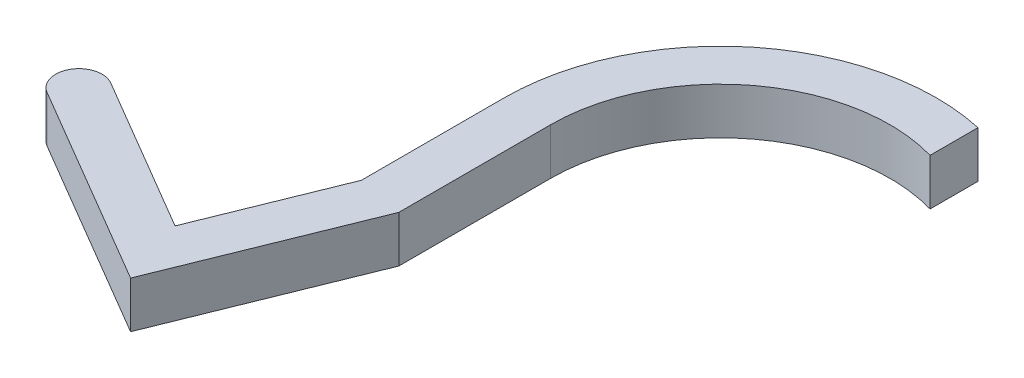
ISO-10303-21;
HEADER;
FILE_DESCRIPTION(('STEP AP214'),'2;1');
FILE_NAME('part.step','',(''),(''),'','','');
FILE_SCHEMA(('AUTOMOTIVE_DESIGN { 1 0 10303 214 1 1 1 1 }'));
ENDSEC;
DATA;
#1=APPLICATION_CONTEXT('core data for automotive mechanical design processes');
#2=APPLICATION_PROTOCOL_DEFINITION('international standard','automotive_design',2000,#1);
#3=PRODUCT_CONTEXT('',#1,'mechanical');
#4=PRODUCT('Part','Part','',(#3));
#5=PRODUCT_RELATED_PRODUCT_CATEGORY('part','',(#4));
#6=PRODUCT_DEFINITION_FORMATION('','',#4);
#7=PRODUCT_DEFINITION_CONTEXT('part definition',#1,'design');
#8=PRODUCT_DEFINITION('design','',#6,#7);
#9=PRODUCT_DEFINITION_SHAPE('','',#8);
#10=(LENGTH_UNIT() NAMED_UNIT(*) SI_UNIT(.MILLI.,.METRE.));
#11=(NAMED_UNIT(*) PLANE_ANGLE_UNIT() SI_UNIT($,.RADIAN.));
#12=(NAMED_UNIT(*) SI_UNIT($,.STERADIAN.) SOLID_ANGLE_UNIT());
#13=UNCERTAINTY_MEASURE_WITH_UNIT(LENGTH_MEASURE(1.E-05),#10,'distance_accuracy_value','');
#14=(GEOMETRIC_REPRESENTATION_CONTEXT(3) GLOBAL_UNCERTAINTY_ASSIGNED_CONTEXT((#13)) GLOBAL_UNIT_ASSIGNED_CONTEXT((#10,
#11,#12)) REPRESENTATION_CONTEXT('',''));
#15=CARTESIAN_POINT('',(0.,0.,0.));
#16=DIRECTION('',(0.,0.,1.));
#17=DIRECTION('',(1.,0.,0.));
#18=AXIS2_PLACEMENT_3D('',#15,#16,#17);
#19=CARTESIAN_POINT('',(0.,10.,0.));
#20=DIRECTION('',(0.,-1.,0.));
#21=DIRECTION('',(0.,0.,-1.));
#22=AXIS2_PLACEMENT_3D('',#19,#20,#21);
#23=CYLINDRICAL_SURFACE('',#22,46.5);
#24=CARTESIAN_POINT('',(0.,0.,0.));
#25=DIRECTION('',(0.,1.,0.));
#26=DIRECTION('',(0.,0.,-1.));
#27=AXIS2_PLACEMENT_3D('',#24,#25,#26);
#28=CIRCLE('',#27,46.5);
#29=CARTESIAN_POINT('',(9.99999999999999,0.,-45.4120028186382));
#30=VERTEX_POINT('',#29);
#31=CARTESIAN_POINT('',(-46.5,0.,0.));
#32=VERTEX_POINT('',#31);
#33=EDGE_CURVE('E128',#30,#32,#28,.T.);
#34=ORIENTED_EDGE('',*,*,#33,.T.);
#35=DIRECTION('',(0.,-1.,0.));
#36=VECTOR('',#35,1.);
#37=CARTESIAN_POINT('',(-46.5,10.,0.));
#38=LINE('',#37,#36);
#39=CARTESIAN_POINT('',(-46.5,10.,0.));
#40=VERTEX_POINT('',#39);
#41=EDGE_CURVE('E11',#40,#32,#38,.T.);
#42=ORIENTED_EDGE('',*,*,#41,.F.);
#43=CARTESIAN_POINT('',(0.,10.,0.));
#44=DIRECTION('',(0.,1.,0.));
#45=DIRECTION('',(0.,0.,-1.));
#46=AXIS2_PLACEMENT_3D('',#43,#44,#45);
#47=CIRCLE('',#46,46.5);
#48=CARTESIAN_POINT('',(9.99999999999999,10.,-45.4120028186382));
#49=VERTEX_POINT('',#48);
#50=EDGE_CURVE('E80',#49,#40,#47,.T.);
#51=ORIENTED_EDGE('',*,*,#50,.F.);
#52=DIRECTION('',(0.,-1.,0.));
#53=VECTOR('',#52,1.);
#54=CARTESIAN_POINT('',(9.99999999999999,10.,-45.4120028186382));
#55=LINE('',#54,#53);
#56=EDGE_CURVE('E191',#49,#30,#55,.T.);
#57=ORIENTED_EDGE('',*,*,#56,.T.);
#58=EDGE_LOOP('',(#34,#42,#51,#57));
#59=FACE_BOUND('',#58,.T.);
#60=ADVANCED_FACE('F38',(#59),#23,.T.);
#61=CARTESIAN_POINT('',(0.,10.,0.));
#62=DIRECTION('',(0.,-1.,0.));
#63=DIRECTION('',(0.,0.,-1.));
#64=AXIS2_PLACEMENT_3D('',#61,#62,#63);
#65=CYLINDRICAL_SURFACE('',#64,36.5);
#66=CARTESIAN_POINT('',(0.,0.,0.));
#67=DIRECTION('',(0.,-1.,0.));
#68=DIRECTION('',(0.,0.,-1.));
#69=AXIS2_PLACEMENT_3D('',#66,#67,#68);
#70=CIRCLE('',#69,36.5);
#71=CARTESIAN_POINT('',(-36.5,0.,0.));
#72=VERTEX_POINT('',#71);
#73=CARTESIAN_POINT('',(9.99999999999999,0.,-35.1034186369362));
#74=VERTEX_POINT('',#73);
#75=EDGE_CURVE('E69',#72,#74,#70,.T.);
#76=ORIENTED_EDGE('',*,*,#75,.T.);
#77=DIRECTION('',(0.,-1.,0.));
#78=VECTOR('',#77,1.);
#79=CARTESIAN_POINT('',(9.99999999999999,10.,-35.1034186369362));
#80=LINE('',#79,#78);
#81=CARTESIAN_POINT('',(9.99999999999999,10.,-35.1034186369362));
#82=VERTEX_POINT('',#81);
#83=EDGE_CURVE('E136',#82,#74,#80,.T.);
#84=ORIENTED_EDGE('',*,*,#83,.F.);
#85=CARTESIAN_POINT('',(0.,10.,0.));
#86=DIRECTION('',(0.,-1.,0.));
#87=DIRECTION('',(0.,0.,-1.));
#88=AXIS2_PLACEMENT_3D('',#85,#86,#87);
#89=CIRCLE('',#88,36.5);
#90=CARTESIAN_POINT('',(-36.5,10.,0.));
#91=VERTEX_POINT('',#90);
#92=EDGE_CURVE('E132',#91,#82,#89,.T.);
#93=ORIENTED_EDGE('',*,*,#92,.F.);
#94=DIRECTION('',(0.,-1.,0.));
#95=VECTOR('',#94,1.);
#96=CARTESIAN_POINT('',(-36.5,10.,0.));
#97=LINE('',#96,#95);
#98=EDGE_CURVE('E46',#91,#72,#97,.T.);
#99=ORIENTED_EDGE('',*,*,#98,.T.);
#100=EDGE_LOOP('',(#76,#84,#93,#99));
#101=FACE_BOUND('',#100,.T.);
#102=ADVANCED_FACE('F131',(#101),#65,.F.);
#103=CARTESIAN_POINT('',(9.99999999999999,10.,-45.4120028186382));
#104=DIRECTION('',(-1.,0.,0.));
#105=DIRECTION('',(0.,0.,1.));
#106=AXIS2_PLACEMENT_3D('',#103,#104,#105);
#107=PLANE('',#106);
#108=DIRECTION('',(0.,0.,-1.));
#109=VECTOR('',#108,1.);
#110=CARTESIAN_POINT('',(9.99999999999999,0.,-45.4120028186382));
#111=LINE('',#110,#109);
#112=EDGE_CURVE('E75',#74,#30,#111,.T.);
#113=ORIENTED_EDGE('',*,*,#112,.T.);
#114=ORIENTED_EDGE('',*,*,#56,.F.);
#115=DIRECTION('',(0.,0.,-1.));
#116=VECTOR('',#115,1.);
#117=CARTESIAN_POINT('',(9.99999999999999,10.,-45.4120028186382));
#118=LINE('',#117,#116);
#119=EDGE_CURVE('E54',#82,#49,#118,.T.);
#120=ORIENTED_EDGE('',*,*,#119,.F.);
#121=ORIENTED_EDGE('',*,*,#83,.T.);
#122=EDGE_LOOP('',(#113,#114,#120,#121));
#123=FACE_BOUND('',#122,.T.);
#124=ADVANCED_FACE('F195',(#123),#107,.F.);
#125=CARTESIAN_POINT('',(0.,10.,0.));
#126=DIRECTION('',(0.,-1.,0.));
#127=DIRECTION('',(0.,0.,-1.));
#128=AXIS2_PLACEMENT_3D('',#125,#126,#127);
#129=PLANE('',#128);
#130=ORIENTED_EDGE('',*,*,#50,.T.);
#131=DIRECTION('',(0.,0.,1.));
#132=VECTOR('',#131,1.);
#133=CARTESIAN_POINT('',(-46.5,10.,0.));
#134=LINE('',#133,#132);
#135=CARTESIAN_POINT('',(-46.5,10.,30.7026845183152));
#136=VERTEX_POINT('',#135);
#137=EDGE_CURVE('E165',#40,#136,#134,.T.);
#138=ORIENTED_EDGE('',*,*,#137,.T.);
#139=DIRECTION('',(-0.374907361228939,0.,0.927062279729012));
#140=VECTOR('',#139,1.);
#141=CARTESIAN_POINT('',(-46.5,10.,30.7026845183152));
#142=LINE('',#141,#140);
#143=CARTESIAN_POINT('',(-58.0348229185915,10.,59.22572870749));
#144=VERTEX_POINT('',#143);
#145=EDGE_CURVE('E167',#136,#144,#142,.T.);
#146=ORIENTED_EDGE('',*,*,#145,.T.);
#147=DIRECTION('',(-0.86216242099645,0.,-0.506631976706504));
#148=VECTOR('',#147,1.);
#149=CARTESIAN_POINT('',(-58.0348229185915,10.,59.22572870749));
#150=LINE('',#149,#148);
#151=CARTESIAN_POINT('',(-91.5996039168601,10.,39.5020769560949));
#152=VERTEX_POINT('',#151);
#153=EDGE_CURVE('E170',#144,#152,#150,.T.);
#154=ORIENTED_EDGE('',*,*,#153,.T.);
#155=CARTESIAN_POINT('',(-94.1327638003926,10.,43.8128890610771));
#156=DIRECTION('',(0.,1.,0.));
#157=DIRECTION('',(0.,0.,1.));
#158=AXIS2_PLACEMENT_3D('',#155,#156,#157);
#159=CIRCLE('',#158,5.);
#160=CARTESIAN_POINT('',(-96.6659236839251,10.,48.1237011660594));
#161=VERTEX_POINT('',#160);
#162=EDGE_CURVE('E173',#152,#161,#159,.T.);
#163=ORIENTED_EDGE('',*,*,#162,.T.);
#164=DIRECTION('',(0.862162420996451,0.,0.506631976706504));
#165=VECTOR('',#164,1.);
#166=CARTESIAN_POINT('',(-96.6659236839251,10.,48.1237011660594));
#167=LINE('',#166,#165);
#168=CARTESIAN_POINT('',(-53.1091654434872,10.,73.7189323996081));
#169=VERTEX_POINT('',#168);
#170=EDGE_CURVE('E146',#161,#169,#167,.T.);
#171=ORIENTED_EDGE('',*,*,#170,.T.);
#172=DIRECTION('',(0.374907361228939,0.,-0.927062279729013));
#173=VECTOR('',#172,1.);
#174=CARTESIAN_POINT('',(-53.1091654434872,10.,73.7189323996081));
#175=LINE('',#174,#173);
#176=CARTESIAN_POINT('',(-36.5,10.,32.6481709988127));
#177=VERTEX_POINT('',#176);
#178=EDGE_CURVE('E140',#169,#177,#175,.T.);
#179=ORIENTED_EDGE('',*,*,#178,.T.);
#180=DIRECTION('',(0.,0.,-1.));
#181=VECTOR('',#180,1.);
#182=CARTESIAN_POINT('',(-36.5,10.,0.));
#183=LINE('',#182,#181);
#184=EDGE_CURVE('E163',#177,#91,#183,.T.);
#185=ORIENTED_EDGE('',*,*,#184,.T.);
#186=ORIENTED_EDGE('',*,*,#92,.T.);
#187=ORIENTED_EDGE('',*,*,#119,.T.);
#188=EDGE_LOOP('',(#130,#138,#146,#154,#163,#171,#179,#185,#186,#187));
#189=FACE_BOUND('',#188,.T.);
#190=ADVANCED_FACE('F202',(#189),#129,.F.);
#191=CARTESIAN_POINT('',(0.,0.,0.));
#192=DIRECTION('',(0.,-1.,0.));
#193=DIRECTION('',(0.,0.,-1.));
#194=AXIS2_PLACEMENT_3D('',#191,#192,#193);
#195=PLANE('',#194);
#196=ORIENTED_EDGE('',*,*,#33,.F.);
#197=ORIENTED_EDGE('',*,*,#112,.F.);
#198=ORIENTED_EDGE('',*,*,#75,.F.);
#199=DIRECTION('',(0.,0.,-1.));
#200=VECTOR('',#199,1.);
#201=CARTESIAN_POINT('',(-36.5,0.,0.));
#202=LINE('',#201,#200);
#203=CARTESIAN_POINT('',(-36.5,0.,32.6481709988127));
#204=VERTEX_POINT('',#203);
#205=EDGE_CURVE('E126',#204,#72,#202,.T.);
#206=ORIENTED_EDGE('',*,*,#205,.F.);
#207=DIRECTION('',(0.374907361228939,0.,-0.927062279729013));
#208=VECTOR('',#207,1.);
#209=CARTESIAN_POINT('',(-53.1091654434872,0.,73.7189323996081));
#210=LINE('',#209,#208);
#211=CARTESIAN_POINT('',(-53.1091654434872,0.,73.7189323996081));
#212=VERTEX_POINT('',#211);
#213=EDGE_CURVE('E160',#212,#204,#210,.T.);
#214=ORIENTED_EDGE('',*,*,#213,.F.);
#215=DIRECTION('',(0.862162420996451,0.,0.506631976706504));
#216=VECTOR('',#215,1.);
#217=CARTESIAN_POINT('',(-96.6659236839251,0.,48.1237011660594));
#218=LINE('',#217,#216);
#219=CARTESIAN_POINT('',(-96.6659236839251,0.,48.1237011660594));
#220=VERTEX_POINT('',#219);
#221=EDGE_CURVE('E157',#220,#212,#218,.T.);
#222=ORIENTED_EDGE('',*,*,#221,.F.);
#223=CARTESIAN_POINT('',(-94.1327638003926,0.,43.8128890610771));
#224=DIRECTION('',(0.,1.,0.));
#225=DIRECTION('',(0.,0.,1.));
#226=AXIS2_PLACEMENT_3D('',#223,#224,#225);
#227=CIRCLE('',#226,5.);
#228=CARTESIAN_POINT('',(-91.5996039168601,0.,39.5020769560949));
#229=VERTEX_POINT('',#228);
#230=EDGE_CURVE('E154',#229,#220,#227,.T.);
#231=ORIENTED_EDGE('',*,*,#230,.F.);
#232=DIRECTION('',(-0.86216242099645,0.,-0.506631976706504));
#233=VECTOR('',#232,1.);
#234=CARTESIAN_POINT('',(-58.0348229185915,0.,59.22572870749));
#235=LINE('',#234,#233);
#236=CARTESIAN_POINT('',(-58.0348229185915,0.,59.22572870749));
#237=VERTEX_POINT('',#236);
#238=EDGE_CURVE('E151',#237,#229,#235,.T.);
#239=ORIENTED_EDGE('',*,*,#238,.F.);
#240=DIRECTION('',(-0.374907361228939,0.,0.927062279729012));
#241=VECTOR('',#240,1.);
#242=CARTESIAN_POINT('',(-46.5,0.,30.7026845183152));
#243=LINE('',#242,#241);
#244=CARTESIAN_POINT('',(-46.5,0.,30.7026845183152));
#245=VERTEX_POINT('',#244);
#246=EDGE_CURVE('E143',#245,#237,#243,.T.);
#247=ORIENTED_EDGE('',*,*,#246,.F.);
#248=DIRECTION('',(0.,0.,1.));
#249=VECTOR('',#248,1.);
#250=CARTESIAN_POINT('',(-46.5,0.,0.));
#251=LINE('',#250,#249);
#252=EDGE_CURVE('E139',#32,#245,#251,.T.);
#253=ORIENTED_EDGE('',*,*,#252,.F.);
#254=EDGE_LOOP('',(#196,#197,#198,#206,#214,#222,#231,#239,#247,#253));
#255=FACE_BOUND('',#254,.T.);
#256=ADVANCED_FACE('F123',(#255),#195,.T.);
#257=CARTESIAN_POINT('',(-36.5,0.,0.));
#258=DIRECTION('',(1.,0.,0.));
#259=DIRECTION('',(0.,0.,-1.));
#260=AXIS2_PLACEMENT_3D('',#257,#258,#259);
#261=PLANE('',#260);
#262=ORIENTED_EDGE('',*,*,#184,.F.);
#263=DIRECTION('',(0.,1.,0.));
#264=VECTOR('',#263,1.);
#265=CARTESIAN_POINT('',(-36.5,0.,32.6481709988127));
#266=LINE('',#265,#264);
#267=EDGE_CURVE('E138',#204,#177,#266,.T.);
#268=ORIENTED_EDGE('',*,*,#267,.F.);
#269=ORIENTED_EDGE('',*,*,#205,.T.);
#270=ORIENTED_EDGE('',*,*,#98,.F.);
#271=EDGE_LOOP('',(#262,#268,#269,#270));
#272=FACE_BOUND('',#271,.T.);
#273=ADVANCED_FACE('F137',(#272),#261,.T.);
#274=CARTESIAN_POINT('',(-53.1091654434872,0.,73.7189323996081));
#275=DIRECTION('',(0.927062279729013,0.,0.374907361228939));
#276=DIRECTION('',(0.374907361228939,0.,-0.927062279729013));
#277=AXIS2_PLACEMENT_3D('',#274,#275,#276);
#278=PLANE('',#277);
#279=ORIENTED_EDGE('',*,*,#178,.F.);
#280=DIRECTION('',(0.,1.,0.));
#281=VECTOR('',#280,1.);
#282=CARTESIAN_POINT('',(-53.1091654434872,0.,73.7189323996081));
#283=LINE('',#282,#281);
#284=EDGE_CURVE('E179',#212,#169,#283,.T.);
#285=ORIENTED_EDGE('',*,*,#284,.F.);
#286=ORIENTED_EDGE('',*,*,#213,.T.);
#287=ORIENTED_EDGE('',*,*,#267,.T.);
#288=EDGE_LOOP('',(#279,#285,#286,#287));
#289=FACE_BOUND('',#288,.T.);
#290=ADVANCED_FACE('F218',(#289),#278,.T.);
#291=CARTESIAN_POINT('',(-96.6659236839251,0.,48.1237011660594));
#292=DIRECTION('',(-0.506631976706504,0.,0.862162420996451));
#293=DIRECTION('',(0.862162420996451,0.,0.506631976706504));
#294=AXIS2_PLACEMENT_3D('',#291,#292,#293);
#295=PLANE('',#294);
#296=ORIENTED_EDGE('',*,*,#170,.F.);
#297=DIRECTION('',(0.,1.,0.));
#298=VECTOR('',#297,1.);
#299=CARTESIAN_POINT('',(-96.6659236839251,0.,48.1237011660594));
#300=LINE('',#299,#298);
#301=EDGE_CURVE('E181',#220,#161,#300,.T.);
#302=ORIENTED_EDGE('',*,*,#301,.F.);
#303=ORIENTED_EDGE('',*,*,#221,.T.);
#304=ORIENTED_EDGE('',*,*,#284,.T.);
#305=EDGE_LOOP('',(#296,#302,#303,#304));
#306=FACE_BOUND('',#305,.T.);
#307=ADVANCED_FACE('F220',(#306),#295,.T.);
#308=CARTESIAN_POINT('',(-94.1327638003926,0.,43.8128890610771));
#309=DIRECTION('',(0.,1.,0.));
#310=DIRECTION('',(0.,0.,1.));
#311=AXIS2_PLACEMENT_3D('',#308,#309,#310);
#312=CYLINDRICAL_SURFACE('',#311,5.);
#313=ORIENTED_EDGE('',*,*,#162,.F.);
#314=DIRECTION('',(0.,1.,0.));
#315=VECTOR('',#314,1.);
#316=CARTESIAN_POINT('',(-91.5996039168601,0.,39.5020769560949));
#317=LINE('',#316,#315);
#318=EDGE_CURVE('E183',#229,#152,#317,.T.);
#319=ORIENTED_EDGE('',*,*,#318,.F.);
#320=ORIENTED_EDGE('',*,*,#230,.T.);
#321=ORIENTED_EDGE('',*,*,#301,.T.);
#322=EDGE_LOOP('',(#313,#319,#320,#321));
#323=FACE_BOUND('',#322,.T.);
#324=ADVANCED_FACE('F213',(#323),#312,.T.);
#325=CARTESIAN_POINT('',(-58.0348229185915,0.,59.22572870749));
#326=DIRECTION('',(0.506631976706504,0.,-0.862162420996451));
#327=DIRECTION('',(-0.862162420996451,0.,-0.506631976706504));
#328=AXIS2_PLACEMENT_3D('',#325,#326,#327);
#329=PLANE('',#328);
#330=ORIENTED_EDGE('',*,*,#153,.F.);
#331=DIRECTION('',(0.,1.,0.));
#332=VECTOR('',#331,1.);
#333=CARTESIAN_POINT('',(-58.0348229185915,0.,59.22572870749));
#334=LINE('',#333,#332);
#335=EDGE_CURVE('E185',#237,#144,#334,.T.);
#336=ORIENTED_EDGE('',*,*,#335,.F.);
#337=ORIENTED_EDGE('',*,*,#238,.T.);
#338=ORIENTED_EDGE('',*,*,#318,.T.);
#339=EDGE_LOOP('',(#330,#336,#337,#338));
#340=FACE_BOUND('',#339,.T.);
#341=ADVANCED_FACE('F209',(#340),#329,.T.);
#342=CARTESIAN_POINT('',(-46.5,0.,30.7026845183152));
#343=DIRECTION('',(-0.927062279729013,0.,-0.374907361228939));
#344=DIRECTION('',(-0.374907361228939,0.,0.927062279729013));
#345=AXIS2_PLACEMENT_3D('',#342,#343,#344);
#346=PLANE('',#345);
#347=ORIENTED_EDGE('',*,*,#145,.F.);
#348=DIRECTION('',(0.,1.,0.));
#349=VECTOR('',#348,1.);
#350=CARTESIAN_POINT('',(-46.5,0.,30.7026845183152));
#351=LINE('',#350,#349);
#352=EDGE_CURVE('E162',#245,#136,#351,.T.);
#353=ORIENTED_EDGE('',*,*,#352,.F.);
#354=ORIENTED_EDGE('',*,*,#246,.T.);
#355=ORIENTED_EDGE('',*,*,#335,.T.);
#356=EDGE_LOOP('',(#347,#353,#354,#355));
#357=FACE_BOUND('',#356,.T.);
#358=ADVANCED_FACE('F205',(#357),#346,.T.);
#359=CARTESIAN_POINT('',(-46.5,0.,0.));
#360=DIRECTION('',(-1.,0.,0.));
#361=DIRECTION('',(0.,0.,1.));
#362=AXIS2_PLACEMENT_3D('',#359,#360,#361);
#363=PLANE('',#362);
#364=ORIENTED_EDGE('',*,*,#137,.F.);
#365=ORIENTED_EDGE('',*,*,#41,.T.);
#366=ORIENTED_EDGE('',*,*,#252,.T.);
#367=ORIENTED_EDGE('',*,*,#352,.T.);
#368=EDGE_LOOP('',(#364,#365,#366,#367));
#369=FACE_BOUND('',#368,.T.);
#370=ADVANCED_FACE('F200',(#369),#363,.T.);
#371=CLOSED_SHELL('',(#60,#102,#124,#190,#256,#273,#290,#307,#324,#341,#358,#370));
#372=MANIFOLD_SOLID_BREP('B2',#371);
#373=ADVANCED_BREP_SHAPE_REPRESENTATION('',(#18,#372),#14);
#374=SHAPE_DEFINITION_REPRESENTATION(#9,#373);
ENDSEC;
END-ISO-10303-21;
